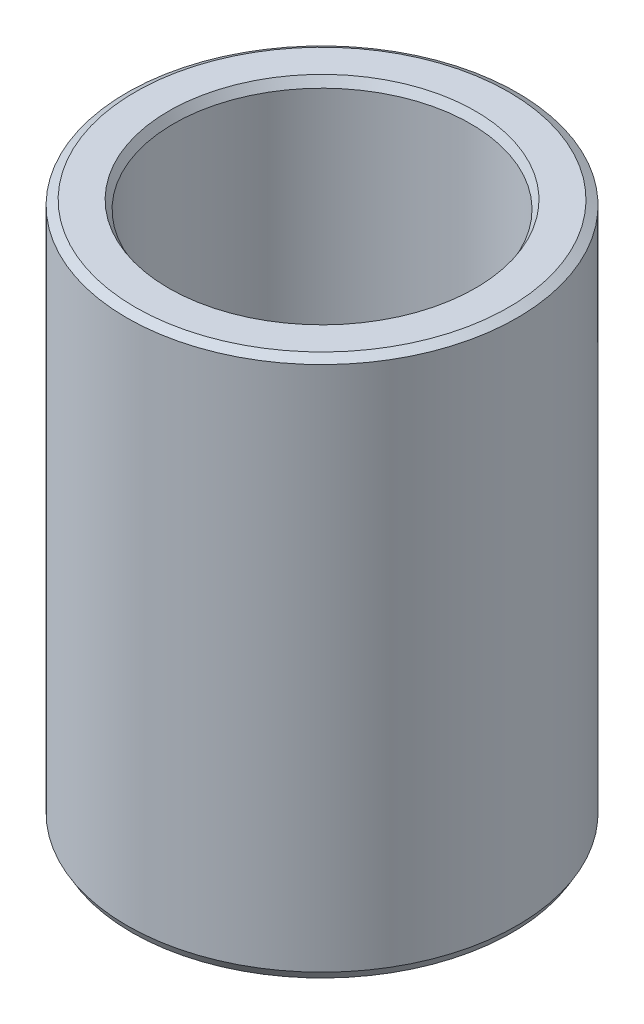
ISO-10303-21;
HEADER;
FILE_DESCRIPTION(('STEP AP214'),'2;1');
FILE_NAME('part.step','',(''),(''),'','','');
FILE_SCHEMA(('AUTOMOTIVE_DESIGN { 1 0 10303 214 1 1 1 1 }'));
ENDSEC;
DATA;
#1=APPLICATION_CONTEXT('core data for automotive mechanical design processes');
#2=APPLICATION_PROTOCOL_DEFINITION('international standard','automotive_design',2000,#1);
#3=PRODUCT_CONTEXT('',#1,'mechanical');
#4=PRODUCT('Part','Part','',(#3));
#5=PRODUCT_RELATED_PRODUCT_CATEGORY('part','',(#4));
#6=PRODUCT_DEFINITION_FORMATION('','',#4);
#7=PRODUCT_DEFINITION_CONTEXT('part definition',#1,'design');
#8=PRODUCT_DEFINITION('design','',#6,#7);
#9=PRODUCT_DEFINITION_SHAPE('','',#8);
#10=(LENGTH_UNIT() NAMED_UNIT(*) SI_UNIT(.MILLI.,.METRE.));
#11=(NAMED_UNIT(*) PLANE_ANGLE_UNIT() SI_UNIT($,.RADIAN.));
#12=(NAMED_UNIT(*) SI_UNIT($,.STERADIAN.) SOLID_ANGLE_UNIT());
#13=UNCERTAINTY_MEASURE_WITH_UNIT(LENGTH_MEASURE(1.E-05),#10,'distance_accuracy_value','');
#14=(GEOMETRIC_REPRESENTATION_CONTEXT(3) GLOBAL_UNCERTAINTY_ASSIGNED_CONTEXT((#13)) GLOBAL_UNIT_ASSIGNED_CONTEXT((#10,
#11,#12)) REPRESENTATION_CONTEXT('',''));
#15=CARTESIAN_POINT('',(0.,0.,0.));
#16=DIRECTION('',(0.,0.,1.));
#17=DIRECTION('',(1.,0.,0.));
#18=AXIS2_PLACEMENT_3D('',#15,#16,#17);
#19=CARTESIAN_POINT('',(0.,124.42920521728,0.));
#20=DIRECTION('',(0.,-1.,0.));
#21=DIRECTION('',(0.,0.,-1.));
#22=AXIS2_PLACEMENT_3D('',#19,#20,#21);
#23=CYLINDRICAL_SURFACE('',#22,45.);
#24=CARTESIAN_POINT('',(0.,1.96122693613611,0.));
#25=DIRECTION('',(0.,1.,0.));
#26=DIRECTION('',(0.,0.,1.));
#27=AXIS2_PLACEMENT_3D('',#24,#25,#26);
#28=CIRCLE('',#27,45.);
#29=CARTESIAN_POINT('',(0.,1.96122693613611,45.));
#30=VERTEX_POINT('',#29);
#31=EDGE_CURVE('E10',#30,#30,#28,.T.);
#32=ORIENTED_EDGE('',*,*,#31,.T.);
#33=EDGE_LOOP('',(#32));
#34=FACE_BOUND('',#33,.T.);
#35=CARTESIAN_POINT('',(0.,123.29689031776,0.));
#36=DIRECTION('',(0.,1.,0.));
#37=DIRECTION('',(0.,0.,1.));
#38=AXIS2_PLACEMENT_3D('',#35,#36,#37);
#39=CIRCLE('',#38,45.);
#40=CARTESIAN_POINT('',(0.,123.29689031776,45.));
#41=VERTEX_POINT('',#40);
#42=EDGE_CURVE('E50',#41,#41,#39,.F.);
#43=ORIENTED_EDGE('',*,*,#42,.T.);
#44=EDGE_LOOP('',(#43));
#45=FACE_BOUND('',#44,.T.);
#46=ADVANCED_FACE('F39',(#34,#45),#23,.T.);
#47=CARTESIAN_POINT('',(0.,124.42920521728,0.));
#48=DIRECTION('',(0.,1.,0.));
#49=DIRECTION('',(0.,0.,1.));
#50=AXIS2_PLACEMENT_3D('',#47,#48,#49);
#51=PLANE('',#50);
#52=CARTESIAN_POINT('',(0.,124.42920521728,0.));
#53=DIRECTION('',(0.,1.,0.));
#54=DIRECTION('',(0.,0.,1.));
#55=AXIS2_PLACEMENT_3D('',#52,#53,#54);
#56=CIRCLE('',#55,35.3750838784449);
#57=CARTESIAN_POINT('',(0.,124.42920521728,35.3750838784449));
#58=VERTEX_POINT('',#57);
#59=EDGE_CURVE('E58',#58,#58,#56,.F.);
#60=ORIENTED_EDGE('',*,*,#59,.T.);
#61=EDGE_LOOP('',(#60));
#62=FACE_BOUND('',#61,.T.);
#63=CARTESIAN_POINT('',(0.,124.42920521728,0.));
#64=DIRECTION('',(0.,1.,0.));
#65=DIRECTION('',(0.,0.,1.));
#66=AXIS2_PLACEMENT_3D('',#63,#64,#65);
#67=CIRCLE('',#66,43.0387730638639);
#68=CARTESIAN_POINT('',(0.,124.42920521728,43.0387730638639));
#69=VERTEX_POINT('',#68);
#70=EDGE_CURVE('E61',#69,#69,#67,.T.);
#71=ORIENTED_EDGE('',*,*,#70,.T.);
#72=EDGE_LOOP('',(#71));
#73=FACE_BOUND('',#72,.T.);
#74=ADVANCED_FACE('F88',(#62,#73),#51,.T.);
#75=CARTESIAN_POINT('',(0.,0.,0.));
#76=DIRECTION('',(0.,1.,0.));
#77=DIRECTION('',(0.,0.,1.));
#78=AXIS2_PLACEMENT_3D('',#75,#76,#77);
#79=PLANE('',#78);
#80=CARTESIAN_POINT('',(0.,0.,0.));
#81=DIRECTION('',(0.,1.,0.));
#82=DIRECTION('',(0.,0.,1.));
#83=AXIS2_PLACEMENT_3D('',#80,#81,#82);
#84=CIRCLE('',#83,36.2039959150609);
#85=CARTESIAN_POINT('',(0.,0.,36.2039959150609));
#86=VERTEX_POINT('',#85);
#87=EDGE_CURVE('E51',#86,#86,#84,.T.);
#88=ORIENTED_EDGE('',*,*,#87,.T.);
#89=EDGE_LOOP('',(#88));
#90=FACE_BOUND('',#89,.T.);
#91=CARTESIAN_POINT('',(0.,0.,0.));
#92=DIRECTION('',(0.,1.,0.));
#93=DIRECTION('',(0.,0.,1.));
#94=AXIS2_PLACEMENT_3D('',#91,#92,#93);
#95=CIRCLE('',#94,43.8676851004799);
#96=CARTESIAN_POINT('',(0.,0.,43.8676851004799));
#97=VERTEX_POINT('',#96);
#98=EDGE_CURVE('E54',#97,#97,#95,.F.);
#99=ORIENTED_EDGE('',*,*,#98,.T.);
#100=EDGE_LOOP('',(#99));
#101=FACE_BOUND('',#100,.T.);
#102=ADVANCED_FACE('F83',(#90,#101),#79,.F.);
#103=CARTESIAN_POINT('',(0.,124.42920521728,0.));
#104=DIRECTION('',(0.,-1.,0.));
#105=DIRECTION('',(0.,0.,-1.));
#106=AXIS2_PLACEMENT_3D('',#103,#104,#105);
#107=CYLINDRICAL_SURFACE('',#106,34.2427689789247);
#108=CARTESIAN_POINT('',(0.,122.467978281144,0.));
#109=DIRECTION('',(0.,1.,0.));
#110=DIRECTION('',(0.,0.,1.));
#111=AXIS2_PLACEMENT_3D('',#108,#109,#110);
#112=CIRCLE('',#111,34.2427689789247);
#113=CARTESIAN_POINT('',(0.,122.467978281144,34.2427689789247));
#114=VERTEX_POINT('',#113);
#115=EDGE_CURVE('E67',#114,#114,#112,.T.);
#116=ORIENTED_EDGE('',*,*,#115,.T.);
#117=EDGE_LOOP('',(#116));
#118=FACE_BOUND('',#117,.T.);
#119=CARTESIAN_POINT('',(0.,1.13231489952019,0.));
#120=DIRECTION('',(0.,1.,0.));
#121=DIRECTION('',(0.,0.,1.));
#122=AXIS2_PLACEMENT_3D('',#119,#120,#121);
#123=CIRCLE('',#122,34.2427689789247);
#124=CARTESIAN_POINT('',(0.,1.13231489952019,34.2427689789247));
#125=VERTEX_POINT('',#124);
#126=EDGE_CURVE('E69',#125,#125,#123,.F.);
#127=ORIENTED_EDGE('',*,*,#126,.T.);
#128=EDGE_LOOP('',(#127));
#129=FACE_BOUND('',#128,.T.);
#130=ADVANCED_FACE('F71',(#118,#129),#107,.F.);
#131=CARTESIAN_POINT('',(0.,122.467978281144,0.));
#132=DIRECTION('',(0.,1.,0.));
#133=DIRECTION('',(0.,0.,1.));
#134=AXIS2_PLACEMENT_3D('',#131,#132,#133);
#135=CONICAL_SURFACE('',#134,34.2427689789247,0.523598775598301);
#136=ORIENTED_EDGE('',*,*,#59,.F.);
#137=EDGE_LOOP('',(#136));
#138=FACE_BOUND('',#137,.T.);
#139=ORIENTED_EDGE('',*,*,#115,.F.);
#140=EDGE_LOOP('',(#139));
#141=FACE_BOUND('',#140,.T.);
#142=ADVANCED_FACE('F77',(#138,#141),#135,.F.);
#143=CARTESIAN_POINT('',(0.,0.,0.));
#144=DIRECTION('',(0.,-1.,0.));
#145=DIRECTION('',(0.,0.,-1.));
#146=AXIS2_PLACEMENT_3D('',#143,#144,#145);
#147=CONICAL_SURFACE('',#146,36.2039959150609,1.04719755119659);
#148=ORIENTED_EDGE('',*,*,#126,.F.);
#149=EDGE_LOOP('',(#148));
#150=FACE_BOUND('',#149,.T.);
#151=ORIENTED_EDGE('',*,*,#87,.F.);
#152=EDGE_LOOP('',(#151));
#153=FACE_BOUND('',#152,.T.);
#154=ADVANCED_FACE('F73',(#150,#153),#147,.F.);
#155=CARTESIAN_POINT('',(0.,1.96122693613611,0.));
#156=DIRECTION('',(0.,1.,0.));
#157=DIRECTION('',(0.,0.,1.));
#158=AXIS2_PLACEMENT_3D('',#155,#156,#157);
#159=CONICAL_SURFACE('',#158,45.,0.523598775598304);
#160=ORIENTED_EDGE('',*,*,#98,.F.);
#161=EDGE_LOOP('',(#160));
#162=FACE_BOUND('',#161,.T.);
#163=ORIENTED_EDGE('',*,*,#31,.F.);
#164=EDGE_LOOP('',(#163));
#165=FACE_BOUND('',#164,.T.);
#166=ADVANCED_FACE('F76',(#162,#165),#159,.T.);
#167=CARTESIAN_POINT('',(0.,124.42920521728,0.));
#168=DIRECTION('',(0.,-1.,0.));
#169=DIRECTION('',(0.,0.,-1.));
#170=AXIS2_PLACEMENT_3D('',#167,#168,#169);
#171=CONICAL_SURFACE('',#170,43.0387730638639,1.04719755119659);
#172=ORIENTED_EDGE('',*,*,#42,.F.);
#173=EDGE_LOOP('',(#172));
#174=FACE_BOUND('',#173,.T.);
#175=ORIENTED_EDGE('',*,*,#70,.F.);
#176=EDGE_LOOP('',(#175));
#177=FACE_BOUND('',#176,.T.);
#178=ADVANCED_FACE('F45',(#174,#177),#171,.T.);
#179=CLOSED_SHELL('',(#46,#74,#102,#130,#142,#154,#166,#178));
#180=MANIFOLD_SOLID_BREP('B2',#179);
#181=ADVANCED_BREP_SHAPE_REPRESENTATION('',(#18,#180),#14);
#182=SHAPE_DEFINITION_REPRESENTATION(#9,#181);
ENDSEC;
END-ISO-10303-21;
